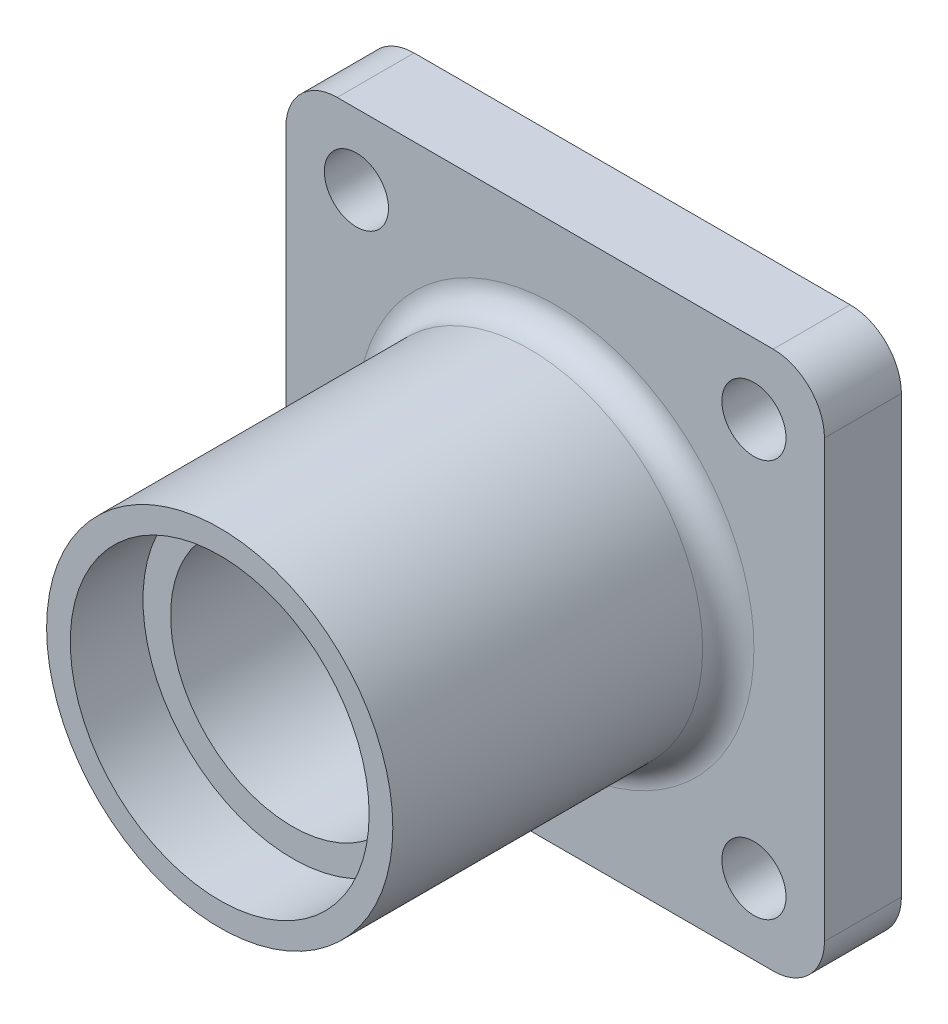
ISO-10303-21;
HEADER;
FILE_DESCRIPTION(('STEP AP214'),'2;1');
FILE_NAME('part.step','',(''),(''),'','','');
FILE_SCHEMA(('AUTOMOTIVE_DESIGN { 1 0 10303 214 1 1 1 1 }'));
ENDSEC;
DATA;
#1=APPLICATION_CONTEXT('core data for automotive mechanical design processes');
#2=APPLICATION_PROTOCOL_DEFINITION('international standard','automotive_design',2000,#1);
#3=PRODUCT_CONTEXT('',#1,'mechanical');
#4=PRODUCT('Part','Part','',(#3));
#5=PRODUCT_RELATED_PRODUCT_CATEGORY('part','',(#4));
#6=PRODUCT_DEFINITION_FORMATION('','',#4);
#7=PRODUCT_DEFINITION_CONTEXT('part definition',#1,'design');
#8=PRODUCT_DEFINITION('design','',#6,#7);
#9=PRODUCT_DEFINITION_SHAPE('','',#8);
#10=(LENGTH_UNIT() NAMED_UNIT(*) SI_UNIT(.MILLI.,.METRE.));
#11=(NAMED_UNIT(*) PLANE_ANGLE_UNIT() SI_UNIT($,.RADIAN.));
#12=(NAMED_UNIT(*) SI_UNIT($,.STERADIAN.) SOLID_ANGLE_UNIT());
#13=UNCERTAINTY_MEASURE_WITH_UNIT(LENGTH_MEASURE(1.E-05),#10,'distance_accuracy_value','');
#14=(GEOMETRIC_REPRESENTATION_CONTEXT(3) GLOBAL_UNCERTAINTY_ASSIGNED_CONTEXT((#13)) GLOBAL_UNIT_ASSIGNED_CONTEXT((#10,
#11,#12)) REPRESENTATION_CONTEXT('',''));
#15=CARTESIAN_POINT('',(0.,0.,0.));
#16=DIRECTION('',(0.,0.,1.));
#17=DIRECTION('',(1.,0.,0.));
#18=AXIS2_PLACEMENT_3D('',#15,#16,#17);
#19=CARTESIAN_POINT('',(0.,0.,-28.2575));
#20=DIRECTION('',(0.,0.,1.));
#21=DIRECTION('',(1.,0.,0.));
#22=AXIS2_PLACEMENT_3D('',#19,#20,#21);
#23=CYLINDRICAL_SURFACE('',#22,15.08125);
#24=CARTESIAN_POINT('',(0.,0.,19.2575));
#25=DIRECTION('',(0.,0.,1.));
#26=DIRECTION('',(1.,0.,0.));
#27=AXIS2_PLACEMENT_3D('',#24,#25,#26);
#28=CIRCLE('',#27,15.08125);
#29=CARTESIAN_POINT('',(15.08125,0.,19.2575));
#30=VERTEX_POINT('',#29);
#31=EDGE_CURVE('E177',#30,#30,#28,.F.);
#32=ORIENTED_EDGE('',*,*,#31,.F.);
#33=EDGE_LOOP('',(#32));
#34=FACE_BOUND('',#33,.T.);
#35=CARTESIAN_POINT('',(0.,0.,-19.2575));
#36=DIRECTION('',(0.,0.,-1.));
#37=DIRECTION('',(-1.,0.,0.));
#38=AXIS2_PLACEMENT_3D('',#35,#36,#37);
#39=CIRCLE('',#38,15.08125);
#40=CARTESIAN_POINT('',(-15.08125,0.,-19.2575));
#41=VERTEX_POINT('',#40);
#42=EDGE_CURVE('E182',#41,#41,#39,.F.);
#43=ORIENTED_EDGE('',*,*,#42,.F.);
#44=EDGE_LOOP('',(#43));
#45=FACE_BOUND('',#44,.T.);
#46=ADVANCED_FACE('F39',(#34,#45),#23,.F.);
#47=CARTESIAN_POINT('',(0.,0.,-28.2575));
#48=DIRECTION('',(0.,0.,1.));
#49=DIRECTION('',(1.,0.,0.));
#50=AXIS2_PLACEMENT_3D('',#47,#48,#49);
#51=CYLINDRICAL_SURFACE('',#50,21.43125);
#52=CARTESIAN_POINT('',(0.,0.,-28.2575));
#53=DIRECTION('',(0.,0.,1.));
#54=DIRECTION('',(1.,0.,0.));
#55=AXIS2_PLACEMENT_3D('',#52,#53,#54);
#56=CIRCLE('',#55,21.43125);
#57=CARTESIAN_POINT('',(21.43125,0.,-28.2575));
#58=VERTEX_POINT('',#57);
#59=EDGE_CURVE('E172',#58,#58,#56,.T.);
#60=ORIENTED_EDGE('',*,*,#59,.T.);
#61=EDGE_LOOP('',(#60));
#62=FACE_BOUND('',#61,.T.);
#63=CARTESIAN_POINT('',(0.,0.,-22.7965));
#64=DIRECTION('',(0.,0.,1.));
#65=DIRECTION('',(1.,0.,0.));
#66=AXIS2_PLACEMENT_3D('',#63,#64,#65);
#67=CIRCLE('',#66,21.43125);
#68=CARTESIAN_POINT('',(21.43125,0.,-22.7965));
#69=VERTEX_POINT('',#68);
#70=EDGE_CURVE('E168',#69,#69,#67,.F.);
#71=ORIENTED_EDGE('',*,*,#70,.T.);
#72=EDGE_LOOP('',(#71));
#73=FACE_BOUND('',#72,.T.);
#74=ADVANCED_FACE('F203',(#62,#73),#51,.T.);
#75=CARTESIAN_POINT('',(0.,0.,-10.0965));
#76=DIRECTION('',(0.,0.,1.));
#77=DIRECTION('',(1.,0.,0.));
#78=AXIS2_PLACEMENT_3D('',#75,#76,#77);
#79=CIRCLE('',#78,21.43125);
#80=CARTESIAN_POINT('',(21.43125,0.,-10.0965));
#81=VERTEX_POINT('',#80);
#82=EDGE_CURVE('E11',#81,#81,#79,.T.);
#83=ORIENTED_EDGE('',*,*,#82,.T.);
#84=EDGE_LOOP('',(#83));
#85=FACE_BOUND('',#84,.T.);
#86=CARTESIAN_POINT('',(0.,0.,28.2575));
#87=DIRECTION('',(0.,0.,1.));
#88=DIRECTION('',(1.,0.,0.));
#89=AXIS2_PLACEMENT_3D('',#86,#87,#88);
#90=CIRCLE('',#89,21.43125);
#91=CARTESIAN_POINT('',(21.43125,0.,28.2575));
#92=VERTEX_POINT('',#91);
#93=EDGE_CURVE('E169',#92,#92,#90,.T.);
#94=ORIENTED_EDGE('',*,*,#93,.F.);
#95=EDGE_LOOP('',(#94));
#96=FACE_BOUND('',#95,.T.);
#97=ADVANCED_FACE('F211',(#85,#96),#51,.T.);
#98=CARTESIAN_POINT('',(0.,0.,-28.2575));
#99=DIRECTION('',(0.,0.,1.));
#100=DIRECTION('',(1.,0.,0.));
#101=AXIS2_PLACEMENT_3D('',#98,#99,#100);
#102=PLANE('',#101);
#103=CARTESIAN_POINT('',(0.,0.,-28.2575));
#104=DIRECTION('',(0.,0.,1.));
#105=DIRECTION('',(1.,0.,0.));
#106=AXIS2_PLACEMENT_3D('',#103,#104,#105);
#107=CIRCLE('',#106,18.5);
#108=CARTESIAN_POINT('',(18.5,0.,-28.2575));
#109=VERTEX_POINT('',#108);
#110=EDGE_CURVE('E445',#109,#109,#107,.T.);
#111=ORIENTED_EDGE('',*,*,#110,.T.);
#112=EDGE_LOOP('',(#111));
#113=FACE_BOUND('',#112,.T.);
#114=ORIENTED_EDGE('',*,*,#59,.F.);
#115=EDGE_LOOP('',(#114));
#116=FACE_BOUND('',#115,.T.);
#117=ADVANCED_FACE('F219',(#113,#116),#102,.F.);
#118=CARTESIAN_POINT('',(0.,0.,28.2575));
#119=DIRECTION('',(0.,0.,1.));
#120=DIRECTION('',(1.,0.,0.));
#121=AXIS2_PLACEMENT_3D('',#118,#119,#120);
#122=PLANE('',#121);
#123=CARTESIAN_POINT('',(0.,0.,28.2575));
#124=DIRECTION('',(0.,0.,1.));
#125=DIRECTION('',(1.,0.,0.));
#126=AXIS2_PLACEMENT_3D('',#123,#124,#125);
#127=CIRCLE('',#126,18.5);
#128=CARTESIAN_POINT('',(18.5,0.,28.2575));
#129=VERTEX_POINT('',#128);
#130=EDGE_CURVE('E184',#129,#129,#127,.T.);
#131=ORIENTED_EDGE('',*,*,#130,.F.);
#132=EDGE_LOOP('',(#131));
#133=FACE_BOUND('',#132,.T.);
#134=ORIENTED_EDGE('',*,*,#93,.T.);
#135=EDGE_LOOP('',(#134));
#136=FACE_BOUND('',#135,.T.);
#137=ADVANCED_FACE('F217',(#133,#136),#122,.T.);
#138=CARTESIAN_POINT('',(-26.9875,-26.9875,-13.2715));
#139=DIRECTION('',(0.,0.,1.));
#140=DIRECTION('',(1.,0.,0.));
#141=AXIS2_PLACEMENT_3D('',#138,#139,#140);
#142=PLANE('',#141);
#143=CARTESIAN_POINT('',(0.,0.,-13.2715));
#144=DIRECTION('',(0.,0.,1.));
#145=DIRECTION('',(1.,0.,0.));
#146=AXIS2_PLACEMENT_3D('',#143,#144,#145);
#147=CIRCLE('',#146,24.60625);
#148=CARTESIAN_POINT('',(24.60625,0.,-13.2715));
#149=VERTEX_POINT('',#148);
#150=EDGE_CURVE('E48',#149,#149,#147,.F.);
#151=ORIENTED_EDGE('',*,*,#150,.T.);
#152=EDGE_LOOP('',(#151));
#153=FACE_BOUND('',#152,.T.);
#154=CARTESIAN_POINT('',(-24.60625,-24.60625,-13.2715));
#155=DIRECTION('',(0.,0.,1.));
#156=DIRECTION('',(1.,0.,0.));
#157=AXIS2_PLACEMENT_3D('',#154,#155,#156);
#158=CIRCLE('',#157,3.96875);
#159=CARTESIAN_POINT('',(-20.6375,-24.60625,-13.2715));
#160=VERTEX_POINT('',#159);
#161=EDGE_CURVE('E244',#160,#160,#158,.T.);
#162=ORIENTED_EDGE('',*,*,#161,.F.);
#163=EDGE_LOOP('',(#162));
#164=FACE_BOUND('',#163,.T.);
#165=CARTESIAN_POINT('',(24.60625,24.60625,-13.2715));
#166=DIRECTION('',(0.,0.,1.));
#167=DIRECTION('',(1.,0.,0.));
#168=AXIS2_PLACEMENT_3D('',#165,#166,#167);
#169=CIRCLE('',#168,3.96875);
#170=CARTESIAN_POINT('',(28.575,24.60625,-13.2715));
#171=VERTEX_POINT('',#170);
#172=EDGE_CURVE('E256',#171,#171,#169,.T.);
#173=ORIENTED_EDGE('',*,*,#172,.F.);
#174=EDGE_LOOP('',(#173));
#175=FACE_BOUND('',#174,.T.);
#176=CARTESIAN_POINT('',(-26.9875,-26.9875,-13.2715));
#177=DIRECTION('',(0.,0.,1.));
#178=DIRECTION('',(1.,0.,0.));
#179=AXIS2_PLACEMENT_3D('',#176,#177,#178);
#180=CIRCLE('',#179,6.35);
#181=CARTESIAN_POINT('',(-33.3375,-26.9875,-13.2715));
#182=VERTEX_POINT('',#181);
#183=CARTESIAN_POINT('',(-26.9875,-33.3375,-13.2715));
#184=VERTEX_POINT('',#183);
#185=EDGE_CURVE('E153',#182,#184,#180,.T.);
#186=ORIENTED_EDGE('',*,*,#185,.T.);
#187=DIRECTION('',(1.,0.,0.));
#188=VECTOR('',#187,1.);
#189=CARTESIAN_POINT('',(-26.9875,-33.3375,-13.2715));
#190=LINE('',#189,#188);
#191=CARTESIAN_POINT('',(26.9875,-33.3375,-13.2715));
#192=VERTEX_POINT('',#191);
#193=EDGE_CURVE('E100',#184,#192,#190,.T.);
#194=ORIENTED_EDGE('',*,*,#193,.T.);
#195=CARTESIAN_POINT('',(26.9875,-26.9875,-13.2715));
#196=DIRECTION('',(0.,0.,1.));
#197=DIRECTION('',(1.,0.,0.));
#198=AXIS2_PLACEMENT_3D('',#195,#196,#197);
#199=CIRCLE('',#198,6.35);
#200=CARTESIAN_POINT('',(33.3375,-26.9875,-13.2715));
#201=VERTEX_POINT('',#200);
#202=EDGE_CURVE('E268',#192,#201,#199,.T.);
#203=ORIENTED_EDGE('',*,*,#202,.T.);
#204=DIRECTION('',(0.,1.,0.));
#205=VECTOR('',#204,1.);
#206=CARTESIAN_POINT('',(33.3375,26.9875,-13.2715));
#207=LINE('',#206,#205);
#208=CARTESIAN_POINT('',(33.3375,26.9875,-13.2715));
#209=VERTEX_POINT('',#208);
#210=EDGE_CURVE('E270',#201,#209,#207,.T.);
#211=ORIENTED_EDGE('',*,*,#210,.T.);
#212=CARTESIAN_POINT('',(26.9875,26.9875,-13.2715));
#213=DIRECTION('',(0.,0.,1.));
#214=DIRECTION('',(-1.,0.,0.));
#215=AXIS2_PLACEMENT_3D('',#212,#213,#214);
#216=CIRCLE('',#215,6.35);
#217=CARTESIAN_POINT('',(26.9875,33.3375,-13.2715));
#218=VERTEX_POINT('',#217);
#219=EDGE_CURVE('E120',#209,#218,#216,.T.);
#220=ORIENTED_EDGE('',*,*,#219,.T.);
#221=DIRECTION('',(-1.,0.,0.));
#222=VECTOR('',#221,1.);
#223=CARTESIAN_POINT('',(-26.9875,33.3375,-13.2715));
#224=LINE('',#223,#222);
#225=CARTESIAN_POINT('',(-26.9875,33.3375,-13.2715));
#226=VERTEX_POINT('',#225);
#227=EDGE_CURVE('E113',#218,#226,#224,.T.);
#228=ORIENTED_EDGE('',*,*,#227,.T.);
#229=CARTESIAN_POINT('',(-26.9875,26.9875,-13.2715));
#230=DIRECTION('',(0.,0.,1.));
#231=DIRECTION('',(1.,0.,0.));
#232=AXIS2_PLACEMENT_3D('',#229,#230,#231);
#233=CIRCLE('',#232,6.35);
#234=CARTESIAN_POINT('',(-33.3375,26.9875,-13.2715));
#235=VERTEX_POINT('',#234);
#236=EDGE_CURVE('E118',#226,#235,#233,.T.);
#237=ORIENTED_EDGE('',*,*,#236,.T.);
#238=DIRECTION('',(0.,-1.,0.));
#239=VECTOR('',#238,1.);
#240=CARTESIAN_POINT('',(-33.3375,26.9875,-13.2715));
#241=LINE('',#240,#239);
#242=EDGE_CURVE('E56',#235,#182,#241,.T.);
#243=ORIENTED_EDGE('',*,*,#242,.T.);
#244=EDGE_LOOP('',(#186,#194,#203,#211,#220,#228,#237,#243));
#245=FACE_BOUND('',#244,.T.);
#246=CARTESIAN_POINT('',(-24.60625,24.60625,-13.2715));
#247=DIRECTION('',(0.,0.,1.));
#248=DIRECTION('',(1.,0.,0.));
#249=AXIS2_PLACEMENT_3D('',#246,#247,#248);
#250=CIRCLE('',#249,3.96875);
#251=CARTESIAN_POINT('',(-20.6375,24.60625,-13.2715));
#252=VERTEX_POINT('',#251);
#253=EDGE_CURVE('E142',#252,#252,#250,.T.);
#254=ORIENTED_EDGE('',*,*,#253,.F.);
#255=EDGE_LOOP('',(#254));
#256=FACE_BOUND('',#255,.T.);
#257=CARTESIAN_POINT('',(24.60625,-24.60625,-13.2715));
#258=DIRECTION('',(0.,0.,1.));
#259=DIRECTION('',(1.,0.,0.));
#260=AXIS2_PLACEMENT_3D('',#257,#258,#259);
#261=CIRCLE('',#260,3.96875);
#262=CARTESIAN_POINT('',(28.575,-24.60625,-13.2715));
#263=VERTEX_POINT('',#262);
#264=EDGE_CURVE('E250',#263,#263,#261,.T.);
#265=ORIENTED_EDGE('',*,*,#264,.F.);
#266=EDGE_LOOP('',(#265));
#267=FACE_BOUND('',#266,.T.);
#268=ADVANCED_FACE('F115',(#153,#164,#175,#245,#256,#267),#142,.T.);
#269=CARTESIAN_POINT('',(-26.9875,-26.9875,-22.7965));
#270=DIRECTION('',(0.,0.,1.));
#271=DIRECTION('',(1.,0.,0.));
#272=AXIS2_PLACEMENT_3D('',#269,#270,#271);
#273=PLANE('',#272);
#274=ORIENTED_EDGE('',*,*,#70,.F.);
#275=EDGE_LOOP('',(#274));
#276=FACE_BOUND('',#275,.T.);
#277=CARTESIAN_POINT('',(-26.9875,-26.9875,-22.7965));
#278=DIRECTION('',(0.,0.,1.));
#279=DIRECTION('',(1.,0.,0.));
#280=AXIS2_PLACEMENT_3D('',#277,#278,#279);
#281=CIRCLE('',#280,6.35);
#282=CARTESIAN_POINT('',(-33.3375,-26.9875,-22.7965));
#283=VERTEX_POINT('',#282);
#284=CARTESIAN_POINT('',(-26.9875,-33.3375,-22.7965));
#285=VERTEX_POINT('',#284);
#286=EDGE_CURVE('E138',#283,#285,#281,.T.);
#287=ORIENTED_EDGE('',*,*,#286,.F.);
#288=DIRECTION('',(0.,-1.,0.));
#289=VECTOR('',#288,1.);
#290=CARTESIAN_POINT('',(-33.3375,26.9875,-22.7965));
#291=LINE('',#290,#289);
#292=CARTESIAN_POINT('',(-33.3375,26.9875,-22.7965));
#293=VERTEX_POINT('',#292);
#294=EDGE_CURVE('E91',#293,#283,#291,.T.);
#295=ORIENTED_EDGE('',*,*,#294,.F.);
#296=CARTESIAN_POINT('',(-26.9875,26.9875,-22.7965));
#297=DIRECTION('',(0.,0.,1.));
#298=DIRECTION('',(1.,0.,0.));
#299=AXIS2_PLACEMENT_3D('',#296,#297,#298);
#300=CIRCLE('',#299,6.35);
#301=CARTESIAN_POINT('',(-26.9875,33.3375,-22.7965));
#302=VERTEX_POINT('',#301);
#303=EDGE_CURVE('E85',#302,#293,#300,.T.);
#304=ORIENTED_EDGE('',*,*,#303,.F.);
#305=DIRECTION('',(-1.,0.,0.));
#306=VECTOR('',#305,1.);
#307=CARTESIAN_POINT('',(-26.9875,33.3375,-22.7965));
#308=LINE('',#307,#306);
#309=CARTESIAN_POINT('',(26.9875,33.3375,-22.7965));
#310=VERTEX_POINT('',#309);
#311=EDGE_CURVE('E128',#310,#302,#308,.T.);
#312=ORIENTED_EDGE('',*,*,#311,.F.);
#313=CARTESIAN_POINT('',(26.9875,26.9875,-22.7965));
#314=DIRECTION('',(0.,0.,1.));
#315=DIRECTION('',(-1.,0.,0.));
#316=AXIS2_PLACEMENT_3D('',#313,#314,#315);
#317=CIRCLE('',#316,6.35);
#318=CARTESIAN_POINT('',(33.3375,26.9875,-22.7965));
#319=VERTEX_POINT('',#318);
#320=EDGE_CURVE('E148',#319,#310,#317,.T.);
#321=ORIENTED_EDGE('',*,*,#320,.F.);
#322=DIRECTION('',(0.,1.,0.));
#323=VECTOR('',#322,1.);
#324=CARTESIAN_POINT('',(33.3375,26.9875,-22.7965));
#325=LINE('',#324,#323);
#326=CARTESIAN_POINT('',(33.3375,-26.9875,-22.7965));
#327=VERTEX_POINT('',#326);
#328=EDGE_CURVE('E146',#327,#319,#325,.T.);
#329=ORIENTED_EDGE('',*,*,#328,.F.);
#330=CARTESIAN_POINT('',(26.9875,-26.9875,-22.7965));
#331=DIRECTION('',(0.,0.,1.));
#332=DIRECTION('',(1.,0.,0.));
#333=AXIS2_PLACEMENT_3D('',#330,#331,#332);
#334=CIRCLE('',#333,6.35);
#335=CARTESIAN_POINT('',(26.9875,-33.3375,-22.7965));
#336=VERTEX_POINT('',#335);
#337=EDGE_CURVE('E144',#336,#327,#334,.T.);
#338=ORIENTED_EDGE('',*,*,#337,.F.);
#339=DIRECTION('',(1.,0.,0.));
#340=VECTOR('',#339,1.);
#341=CARTESIAN_POINT('',(-26.9875,-33.3375,-22.7965));
#342=LINE('',#341,#340);
#343=EDGE_CURVE('E141',#285,#336,#342,.T.);
#344=ORIENTED_EDGE('',*,*,#343,.F.);
#345=EDGE_LOOP('',(#287,#295,#304,#312,#321,#329,#338,#344));
#346=FACE_BOUND('',#345,.T.);
#347=CARTESIAN_POINT('',(-24.60625,24.60625,-22.7965));
#348=DIRECTION('',(0.,0.,1.));
#349=DIRECTION('',(1.,0.,0.));
#350=AXIS2_PLACEMENT_3D('',#347,#348,#349);
#351=CIRCLE('',#350,3.96875);
#352=CARTESIAN_POINT('',(-20.6375,24.60625,-22.7965));
#353=VERTEX_POINT('',#352);
#354=EDGE_CURVE('E259',#353,#353,#351,.T.);
#355=ORIENTED_EDGE('',*,*,#354,.T.);
#356=EDGE_LOOP('',(#355));
#357=FACE_BOUND('',#356,.T.);
#358=CARTESIAN_POINT('',(24.60625,24.60625,-22.7965));
#359=DIRECTION('',(0.,0.,1.));
#360=DIRECTION('',(1.,0.,0.));
#361=AXIS2_PLACEMENT_3D('',#358,#359,#360);
#362=CIRCLE('',#361,3.96875);
#363=CARTESIAN_POINT('',(28.575,24.60625,-22.7965));
#364=VERTEX_POINT('',#363);
#365=EDGE_CURVE('E253',#364,#364,#362,.T.);
#366=ORIENTED_EDGE('',*,*,#365,.T.);
#367=EDGE_LOOP('',(#366));
#368=FACE_BOUND('',#367,.T.);
#369=CARTESIAN_POINT('',(24.60625,-24.60625,-22.7965));
#370=DIRECTION('',(0.,0.,1.));
#371=DIRECTION('',(1.,0.,0.));
#372=AXIS2_PLACEMENT_3D('',#369,#370,#371);
#373=CIRCLE('',#372,3.96875);
#374=CARTESIAN_POINT('',(28.575,-24.60625,-22.7965));
#375=VERTEX_POINT('',#374);
#376=EDGE_CURVE('E247',#375,#375,#373,.T.);
#377=ORIENTED_EDGE('',*,*,#376,.T.);
#378=EDGE_LOOP('',(#377));
#379=FACE_BOUND('',#378,.T.);
#380=CARTESIAN_POINT('',(-24.60625,-24.60625,-22.7965));
#381=DIRECTION('',(0.,0.,1.));
#382=DIRECTION('',(1.,0.,0.));
#383=AXIS2_PLACEMENT_3D('',#380,#381,#382);
#384=CIRCLE('',#383,3.96875);
#385=CARTESIAN_POINT('',(-20.6375,-24.60625,-22.7965));
#386=VERTEX_POINT('',#385);
#387=EDGE_CURVE('E180',#386,#386,#384,.T.);
#388=ORIENTED_EDGE('',*,*,#387,.T.);
#389=EDGE_LOOP('',(#388));
#390=FACE_BOUND('',#389,.T.);
#391=ADVANCED_FACE('F234',(#276,#346,#357,#368,#379,#390),#273,.F.);
#392=CARTESIAN_POINT('',(-26.9875,-26.9875,-13.2715));
#393=DIRECTION('',(0.,0.,-1.));
#394=DIRECTION('',(-1.,0.,0.));
#395=AXIS2_PLACEMENT_3D('',#392,#393,#394);
#396=CYLINDRICAL_SURFACE('',#395,6.35);
#397=ORIENTED_EDGE('',*,*,#286,.T.);
#398=DIRECTION('',(0.,0.,-1.));
#399=VECTOR('',#398,1.);
#400=CARTESIAN_POINT('',(-26.9875,-33.3375,-13.2715));
#401=LINE('',#400,#399);
#402=EDGE_CURVE('E166',#184,#285,#401,.T.);
#403=ORIENTED_EDGE('',*,*,#402,.F.);
#404=ORIENTED_EDGE('',*,*,#185,.F.);
#405=DIRECTION('',(0.,0.,-1.));
#406=VECTOR('',#405,1.);
#407=CARTESIAN_POINT('',(-33.3375,-26.9875,-13.2715));
#408=LINE('',#407,#406);
#409=EDGE_CURVE('E134',#182,#283,#408,.T.);
#410=ORIENTED_EDGE('',*,*,#409,.T.);
#411=EDGE_LOOP('',(#397,#403,#404,#410));
#412=FACE_BOUND('',#411,.T.);
#413=ADVANCED_FACE('F287',(#412),#396,.T.);
#414=CARTESIAN_POINT('',(-26.9875,-33.3375,-13.2715));
#415=DIRECTION('',(0.,1.,0.));
#416=DIRECTION('',(0.,0.,1.));
#417=AXIS2_PLACEMENT_3D('',#414,#415,#416);
#418=PLANE('',#417);
#419=ORIENTED_EDGE('',*,*,#343,.T.);
#420=DIRECTION('',(0.,0.,-1.));
#421=VECTOR('',#420,1.);
#422=CARTESIAN_POINT('',(26.9875,-33.3375,-13.2715));
#423=LINE('',#422,#421);
#424=EDGE_CURVE('E163',#192,#336,#423,.T.);
#425=ORIENTED_EDGE('',*,*,#424,.F.);
#426=ORIENTED_EDGE('',*,*,#193,.F.);
#427=ORIENTED_EDGE('',*,*,#402,.T.);
#428=EDGE_LOOP('',(#419,#425,#426,#427));
#429=FACE_BOUND('',#428,.T.);
#430=ADVANCED_FACE('F312',(#429),#418,.F.);
#431=CARTESIAN_POINT('',(26.9875,-26.9875,-13.2715));
#432=DIRECTION('',(0.,0.,-1.));
#433=DIRECTION('',(-1.,0.,0.));
#434=AXIS2_PLACEMENT_3D('',#431,#432,#433);
#435=CYLINDRICAL_SURFACE('',#434,6.35);
#436=ORIENTED_EDGE('',*,*,#337,.T.);
#437=DIRECTION('',(0.,0.,-1.));
#438=VECTOR('',#437,1.);
#439=CARTESIAN_POINT('',(33.3375,-26.9875,-13.2715));
#440=LINE('',#439,#438);
#441=EDGE_CURVE('E160',#201,#327,#440,.T.);
#442=ORIENTED_EDGE('',*,*,#441,.F.);
#443=ORIENTED_EDGE('',*,*,#202,.F.);
#444=ORIENTED_EDGE('',*,*,#424,.T.);
#445=EDGE_LOOP('',(#436,#442,#443,#444));
#446=FACE_BOUND('',#445,.T.);
#447=ADVANCED_FACE('F309',(#446),#435,.T.);
#448=CARTESIAN_POINT('',(33.3375,26.9875,-13.2715));
#449=DIRECTION('',(-1.,0.,0.));
#450=DIRECTION('',(0.,-1.,0.));
#451=AXIS2_PLACEMENT_3D('',#448,#449,#450);
#452=PLANE('',#451);
#453=ORIENTED_EDGE('',*,*,#328,.T.);
#454=DIRECTION('',(0.,0.,-1.));
#455=VECTOR('',#454,1.);
#456=CARTESIAN_POINT('',(33.3375,26.9875,-13.2715));
#457=LINE('',#456,#455);
#458=EDGE_CURVE('E157',#209,#319,#457,.T.);
#459=ORIENTED_EDGE('',*,*,#458,.F.);
#460=ORIENTED_EDGE('',*,*,#210,.F.);
#461=ORIENTED_EDGE('',*,*,#441,.T.);
#462=EDGE_LOOP('',(#453,#459,#460,#461));
#463=FACE_BOUND('',#462,.T.);
#464=ADVANCED_FACE('F276',(#463),#452,.F.);
#465=CARTESIAN_POINT('',(26.9875,26.9875,-13.2715));
#466=DIRECTION('',(0.,0.,-1.));
#467=DIRECTION('',(-1.,0.,0.));
#468=AXIS2_PLACEMENT_3D('',#465,#466,#467);
#469=CYLINDRICAL_SURFACE('',#468,6.35);
#470=ORIENTED_EDGE('',*,*,#320,.T.);
#471=DIRECTION('',(0.,0.,-1.));
#472=VECTOR('',#471,1.);
#473=CARTESIAN_POINT('',(26.9875,33.3375,-13.2715));
#474=LINE('',#473,#472);
#475=EDGE_CURVE('E129',#218,#310,#474,.T.);
#476=ORIENTED_EDGE('',*,*,#475,.F.);
#477=ORIENTED_EDGE('',*,*,#219,.F.);
#478=ORIENTED_EDGE('',*,*,#458,.T.);
#479=EDGE_LOOP('',(#470,#476,#477,#478));
#480=FACE_BOUND('',#479,.T.);
#481=ADVANCED_FACE('F280',(#480),#469,.T.);
#482=CARTESIAN_POINT('',(-26.9875,33.3375,-13.2715));
#483=DIRECTION('',(0.,-1.,0.));
#484=DIRECTION('',(0.,0.,-1.));
#485=AXIS2_PLACEMENT_3D('',#482,#483,#484);
#486=PLANE('',#485);
#487=ORIENTED_EDGE('',*,*,#311,.T.);
#488=DIRECTION('',(0.,0.,-1.));
#489=VECTOR('',#488,1.);
#490=CARTESIAN_POINT('',(-26.9875,33.3375,-13.2715));
#491=LINE('',#490,#489);
#492=EDGE_CURVE('E125',#226,#302,#491,.T.);
#493=ORIENTED_EDGE('',*,*,#492,.F.);
#494=ORIENTED_EDGE('',*,*,#227,.F.);
#495=ORIENTED_EDGE('',*,*,#475,.T.);
#496=EDGE_LOOP('',(#487,#493,#494,#495));
#497=FACE_BOUND('',#496,.T.);
#498=ADVANCED_FACE('F126',(#497),#486,.F.);
#499=CARTESIAN_POINT('',(-26.9875,26.9875,-13.2715));
#500=DIRECTION('',(0.,0.,-1.));
#501=DIRECTION('',(-1.,0.,0.));
#502=AXIS2_PLACEMENT_3D('',#499,#500,#501);
#503=CYLINDRICAL_SURFACE('',#502,6.35);
#504=ORIENTED_EDGE('',*,*,#303,.T.);
#505=DIRECTION('',(0.,0.,-1.));
#506=VECTOR('',#505,1.);
#507=CARTESIAN_POINT('',(-33.3375,26.9875,-13.2715));
#508=LINE('',#507,#506);
#509=EDGE_CURVE('E130',#235,#293,#508,.T.);
#510=ORIENTED_EDGE('',*,*,#509,.F.);
#511=ORIENTED_EDGE('',*,*,#236,.F.);
#512=ORIENTED_EDGE('',*,*,#492,.T.);
#513=EDGE_LOOP('',(#504,#510,#511,#512));
#514=FACE_BOUND('',#513,.T.);
#515=ADVANCED_FACE('F132',(#514),#503,.T.);
#516=CARTESIAN_POINT('',(-33.3375,26.9875,-13.2715));
#517=DIRECTION('',(1.,0.,0.));
#518=DIRECTION('',(0.,1.,0.));
#519=AXIS2_PLACEMENT_3D('',#516,#517,#518);
#520=PLANE('',#519);
#521=ORIENTED_EDGE('',*,*,#294,.T.);
#522=ORIENTED_EDGE('',*,*,#409,.F.);
#523=ORIENTED_EDGE('',*,*,#242,.F.);
#524=ORIENTED_EDGE('',*,*,#509,.T.);
#525=EDGE_LOOP('',(#521,#522,#523,#524));
#526=FACE_BOUND('',#525,.T.);
#527=ADVANCED_FACE('F289',(#526),#520,.F.);
#528=CARTESIAN_POINT('',(-24.60625,24.60625,-13.2715));
#529=DIRECTION('',(0.,0.,-1.));
#530=DIRECTION('',(-1.,0.,0.));
#531=AXIS2_PLACEMENT_3D('',#528,#529,#530);
#532=CYLINDRICAL_SURFACE('',#531,3.96875);
#533=ORIENTED_EDGE('',*,*,#253,.T.);
#534=EDGE_LOOP('',(#533));
#535=FACE_BOUND('',#534,.T.);
#536=ORIENTED_EDGE('',*,*,#354,.F.);
#537=EDGE_LOOP('',(#536));
#538=FACE_BOUND('',#537,.T.);
#539=ADVANCED_FACE('F291',(#535,#538),#532,.F.);
#540=CARTESIAN_POINT('',(24.60625,24.60625,-13.2715));
#541=DIRECTION('',(0.,0.,-1.));
#542=DIRECTION('',(-1.,0.,0.));
#543=AXIS2_PLACEMENT_3D('',#540,#541,#542);
#544=CYLINDRICAL_SURFACE('',#543,3.96875);
#545=ORIENTED_EDGE('',*,*,#172,.T.);
#546=EDGE_LOOP('',(#545));
#547=FACE_BOUND('',#546,.T.);
#548=ORIENTED_EDGE('',*,*,#365,.F.);
#549=EDGE_LOOP('',(#548));
#550=FACE_BOUND('',#549,.T.);
#551=ADVANCED_FACE('F297',(#547,#550),#544,.F.);
#552=CARTESIAN_POINT('',(24.60625,-24.60625,-13.2715));
#553=DIRECTION('',(0.,0.,-1.));
#554=DIRECTION('',(-1.,0.,0.));
#555=AXIS2_PLACEMENT_3D('',#552,#553,#554);
#556=CYLINDRICAL_SURFACE('',#555,3.96875);
#557=ORIENTED_EDGE('',*,*,#264,.T.);
#558=EDGE_LOOP('',(#557));
#559=FACE_BOUND('',#558,.T.);
#560=ORIENTED_EDGE('',*,*,#376,.F.);
#561=EDGE_LOOP('',(#560));
#562=FACE_BOUND('',#561,.T.);
#563=ADVANCED_FACE('F376',(#559,#562),#556,.F.);
#564=CARTESIAN_POINT('',(-24.60625,-24.60625,-13.2715));
#565=DIRECTION('',(0.,0.,-1.));
#566=DIRECTION('',(-1.,0.,0.));
#567=AXIS2_PLACEMENT_3D('',#564,#565,#566);
#568=CYLINDRICAL_SURFACE('',#567,3.96875);
#569=ORIENTED_EDGE('',*,*,#161,.T.);
#570=EDGE_LOOP('',(#569));
#571=FACE_BOUND('',#570,.T.);
#572=ORIENTED_EDGE('',*,*,#387,.F.);
#573=EDGE_LOOP('',(#572));
#574=FACE_BOUND('',#573,.T.);
#575=ADVANCED_FACE('F369',(#571,#574),#568,.F.);
#576=CARTESIAN_POINT('',(0.,0.,19.2575));
#577=DIRECTION('',(0.,0.,1.));
#578=DIRECTION('',(1.,0.,0.));
#579=AXIS2_PLACEMENT_3D('',#576,#577,#578);
#580=PLANE('',#579);
#581=CARTESIAN_POINT('',(0.,0.,19.2575));
#582=DIRECTION('',(0.,0.,1.));
#583=DIRECTION('',(1.,0.,0.));
#584=AXIS2_PLACEMENT_3D('',#581,#582,#583);
#585=CIRCLE('',#584,18.5);
#586=CARTESIAN_POINT('',(18.5,0.,19.2575));
#587=VERTEX_POINT('',#586);
#588=EDGE_CURVE('E181',#587,#587,#585,.T.);
#589=ORIENTED_EDGE('',*,*,#588,.T.);
#590=EDGE_LOOP('',(#589));
#591=FACE_BOUND('',#590,.T.);
#592=ORIENTED_EDGE('',*,*,#31,.T.);
#593=EDGE_LOOP('',(#592));
#594=FACE_BOUND('',#593,.T.);
#595=ADVANCED_FACE('F362',(#591,#594),#580,.T.);
#596=CARTESIAN_POINT('',(0.,0.,19.2575));
#597=DIRECTION('',(0.,0.,1.));
#598=DIRECTION('',(1.,0.,0.));
#599=AXIS2_PLACEMENT_3D('',#596,#597,#598);
#600=CYLINDRICAL_SURFACE('',#599,18.5);
#601=ORIENTED_EDGE('',*,*,#588,.F.);
#602=EDGE_LOOP('',(#601));
#603=FACE_BOUND('',#602,.T.);
#604=ORIENTED_EDGE('',*,*,#130,.T.);
#605=EDGE_LOOP('',(#604));
#606=FACE_BOUND('',#605,.T.);
#607=ADVANCED_FACE('F345',(#603,#606),#600,.F.);
#608=CARTESIAN_POINT('',(0.,0.,-19.2575));
#609=DIRECTION('',(0.,0.,-1.));
#610=DIRECTION('',(1.,0.,0.));
#611=AXIS2_PLACEMENT_3D('',#608,#609,#610);
#612=PLANE('',#611);
#613=CARTESIAN_POINT('',(0.,0.,-19.2575));
#614=DIRECTION('',(0.,0.,1.));
#615=DIRECTION('',(1.,0.,0.));
#616=AXIS2_PLACEMENT_3D('',#613,#614,#615);
#617=CIRCLE('',#616,18.5);
#618=CARTESIAN_POINT('',(18.5,0.,-19.2575));
#619=VERTEX_POINT('',#618);
#620=EDGE_CURVE('E185',#619,#619,#617,.T.);
#621=ORIENTED_EDGE('',*,*,#620,.F.);
#622=EDGE_LOOP('',(#621));
#623=FACE_BOUND('',#622,.T.);
#624=ORIENTED_EDGE('',*,*,#42,.T.);
#625=EDGE_LOOP('',(#624));
#626=FACE_BOUND('',#625,.T.);
#627=ADVANCED_FACE('F198',(#623,#626),#612,.T.);
#628=CARTESIAN_POINT('',(0.,0.,-19.2575));
#629=DIRECTION('',(0.,0.,-1.));
#630=DIRECTION('',(-1.,0.,0.));
#631=AXIS2_PLACEMENT_3D('',#628,#629,#630);
#632=CYLINDRICAL_SURFACE('',#631,18.5);
#633=ORIENTED_EDGE('',*,*,#620,.T.);
#634=EDGE_LOOP('',(#633));
#635=FACE_BOUND('',#634,.T.);
#636=ORIENTED_EDGE('',*,*,#110,.F.);
#637=EDGE_LOOP('',(#636));
#638=FACE_BOUND('',#637,.T.);
#639=ADVANCED_FACE('F192',(#635,#638),#632,.F.);
#640=CARTESIAN_POINT('',(0.,0.,-10.0965));
#641=DIRECTION('',(0.,0.,1.));
#642=DIRECTION('',(1.,0.,0.));
#643=AXIS2_PLACEMENT_3D('',#640,#641,#642);
#644=TOROIDAL_SURFACE('',#643,24.60625,3.175);
#645=ORIENTED_EDGE('',*,*,#82,.F.);
#646=EDGE_LOOP('',(#645));
#647=FACE_BOUND('',#646,.T.);
#648=ORIENTED_EDGE('',*,*,#150,.F.);
#649=EDGE_LOOP('',(#648));
#650=FACE_BOUND('',#649,.T.);
#651=ADVANCED_FACE('F41',(#647,#650),#644,.F.);
#652=CLOSED_SHELL('',(#46,#74,#97,#117,#137,#268,#391,#413,#430,#447,#464,#481,#498,#515,#527,
#539,#551,#563,#575,#595,#607,#627,#639,#651));
#653=MANIFOLD_SOLID_BREP('B2',#652);
#654=ADVANCED_BREP_SHAPE_REPRESENTATION('',(#18,#653),#14);
#655=SHAPE_DEFINITION_REPRESENTATION(#9,#654);
ENDSEC;
END-ISO-10303-21;
